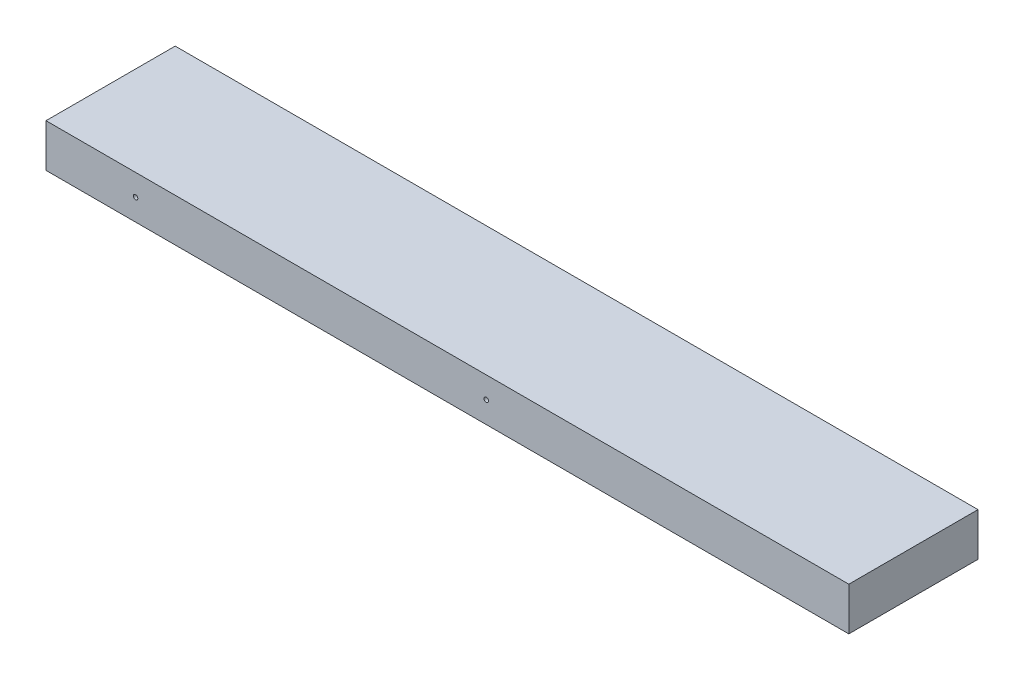
ISO-10303-21;
HEADER;
FILE_DESCRIPTION(('STEP AP214'),'2;1');
FILE_NAME('part.step','',(''),(''),'','','');
FILE_SCHEMA(('AUTOMOTIVE_DESIGN { 1 0 10303 214 1 1 1 1 }'));
ENDSEC;
DATA;
#1=APPLICATION_CONTEXT('core data for automotive mechanical design processes');
#2=APPLICATION_PROTOCOL_DEFINITION('international standard','automotive_design',2000,#1);
#3=PRODUCT_CONTEXT('',#1,'mechanical');
#4=PRODUCT('Part','Part','',(#3));
#5=PRODUCT_RELATED_PRODUCT_CATEGORY('part','',(#4));
#6=PRODUCT_DEFINITION_FORMATION('','',#4);
#7=PRODUCT_DEFINITION_CONTEXT('part definition',#1,'design');
#8=PRODUCT_DEFINITION('design','',#6,#7);
#9=PRODUCT_DEFINITION_SHAPE('','',#8);
#10=(LENGTH_UNIT() NAMED_UNIT(*) SI_UNIT(.MILLI.,.METRE.));
#11=(NAMED_UNIT(*) PLANE_ANGLE_UNIT() SI_UNIT($,.RADIAN.));
#12=(NAMED_UNIT(*) SI_UNIT($,.STERADIAN.) SOLID_ANGLE_UNIT());
#13=UNCERTAINTY_MEASURE_WITH_UNIT(LENGTH_MEASURE(1.E-05),#10,'distance_accuracy_value','');
#14=(GEOMETRIC_REPRESENTATION_CONTEXT(3) GLOBAL_UNCERTAINTY_ASSIGNED_CONTEXT((#13)) GLOBAL_UNIT_ASSIGNED_CONTEXT((#10,
#11,#12)) REPRESENTATION_CONTEXT('',''));
#15=CARTESIAN_POINT('',(0.,0.,0.));
#16=DIRECTION('',(0.,0.,1.));
#17=DIRECTION('',(1.,0.,0.));
#18=AXIS2_PLACEMENT_3D('',#15,#16,#17);
#19=CARTESIAN_POINT('',(86.3599999999995,5213.35,2683.51));
#20=DIRECTION('',(0.,-1.,0.));
#21=DIRECTION('',(0.,0.,-1.));
#22=AXIS2_PLACEMENT_3D('',#19,#20,#21);
#23=PLANE('',#22);
#24=DIRECTION('',(0.,0.,-1.));
#25=VECTOR('',#24,1.);
#26=CARTESIAN_POINT('',(90.1229654482441,5213.35,2740.66));
#27=LINE('',#26,#25);
#28=CARTESIAN_POINT('',(90.1229654482441,5213.35,2740.66));
#29=VERTEX_POINT('',#28);
#30=CARTESIAN_POINT('',(90.1229654482441,5213.35,2683.51));
#31=VERTEX_POINT('',#30);
#32=EDGE_CURVE('E96',#29,#31,#27,.T.);
#33=ORIENTED_EDGE('',*,*,#32,.T.);
#34=DIRECTION('',(1.,0.,0.));
#35=VECTOR('',#34,1.);
#36=CARTESIAN_POINT('',(265.815570864871,5213.35,2683.51));
#37=LINE('',#36,#35);
#38=CARTESIAN_POINT('',(445.271141729743,5213.35,2683.51));
#39=VERTEX_POINT('',#38);
#40=EDGE_CURVE('E102',#31,#39,#37,.T.);
#41=ORIENTED_EDGE('',*,*,#40,.T.);
#42=DIRECTION('',(0.,0.,-1.));
#43=VECTOR('',#42,1.);
#44=CARTESIAN_POINT('',(445.271141729743,5213.35,2683.51));
#45=LINE('',#44,#43);
#46=CARTESIAN_POINT('',(445.271141729743,5213.35,2740.66));
#47=VERTEX_POINT('',#46);
#48=EDGE_CURVE('E113',#47,#39,#45,.T.);
#49=ORIENTED_EDGE('',*,*,#48,.F.);
#50=DIRECTION('',(-1.,0.,0.));
#51=VECTOR('',#50,1.);
#52=CARTESIAN_POINT('',(265.815570864871,5213.35,2740.66));
#53=LINE('',#52,#51);
#54=EDGE_CURVE('E75',#47,#29,#53,.T.);
#55=ORIENTED_EDGE('',*,*,#54,.T.);
#56=EDGE_LOOP('',(#33,#41,#49,#55));
#57=FACE_BOUND('',#56,.T.);
#58=ADVANCED_FACE('F35',(#57),#23,.T.);
#59=CARTESIAN_POINT('',(265.815570864871,5222.875,2740.66));
#60=DIRECTION('',(0.,0.,-1.));
#61=DIRECTION('',(-1.,0.,0.));
#62=AXIS2_PLACEMENT_3D('',#59,#60,#61);
#63=PLANE('',#62);
#64=CARTESIAN_POINT('',(129.74574903147,5222.875,2740.66));
#65=DIRECTION('',(0.,0.,-1.));
#66=DIRECTION('',(-1.,0.,0.));
#67=AXIS2_PLACEMENT_3D('',#64,#65,#66);
#68=CIRCLE('',#67,0.991870000000006);
#69=CARTESIAN_POINT('',(128.75387903147,5222.875,2740.66));
#70=VERTEX_POINT('',#69);
#71=EDGE_CURVE('E38',#70,#70,#68,.T.);
#72=ORIENTED_EDGE('',*,*,#71,.T.);
#73=EDGE_LOOP('',(#72));
#74=FACE_BOUND('',#73,.T.);
#75=CARTESIAN_POINT('',(284.876857239857,5222.875,2740.66));
#76=DIRECTION('',(0.,0.,-1.));
#77=DIRECTION('',(-1.,0.,0.));
#78=AXIS2_PLACEMENT_3D('',#75,#76,#77);
#79=CIRCLE('',#78,0.991870000000006);
#80=CARTESIAN_POINT('',(283.884987239857,5222.875,2740.66));
#81=VERTEX_POINT('',#80);
#82=EDGE_CURVE('E117',#81,#81,#79,.T.);
#83=ORIENTED_EDGE('',*,*,#82,.T.);
#84=EDGE_LOOP('',(#83));
#85=FACE_BOUND('',#84,.T.);
#86=DIRECTION('',(1.,0.,0.));
#87=VECTOR('',#86,1.);
#88=CARTESIAN_POINT('',(445.271141729743,5232.4,2740.66));
#89=LINE('',#88,#87);
#90=CARTESIAN_POINT('',(90.1229654482441,5232.4,2740.66));
#91=VERTEX_POINT('',#90);
#92=CARTESIAN_POINT('',(445.271141729743,5232.4,2740.66));
#93=VERTEX_POINT('',#92);
#94=EDGE_CURVE('E105',#91,#93,#89,.T.);
#95=ORIENTED_EDGE('',*,*,#94,.F.);
#96=DIRECTION('',(0.,-1.,0.));
#97=VECTOR('',#96,1.);
#98=CARTESIAN_POINT('',(90.1229654482441,5213.35,2740.66));
#99=LINE('',#98,#97);
#100=EDGE_CURVE('E51',#91,#29,#99,.T.);
#101=ORIENTED_EDGE('',*,*,#100,.T.);
#102=ORIENTED_EDGE('',*,*,#54,.F.);
#103=DIRECTION('',(0.,1.,0.));
#104=VECTOR('',#103,1.);
#105=CARTESIAN_POINT('',(445.271141729743,5213.35,2740.66));
#106=LINE('',#105,#104);
#107=EDGE_CURVE('E115',#93,#47,#106,.F.);
#108=ORIENTED_EDGE('',*,*,#107,.F.);
#109=EDGE_LOOP('',(#95,#101,#102,#108));
#110=FACE_BOUND('',#109,.T.);
#111=ADVANCED_FACE('F131',(#74,#85,#110),#63,.F.);
#112=CARTESIAN_POINT('',(445.271141729743,5213.35,2683.51));
#113=DIRECTION('',(1.,0.,0.));
#114=DIRECTION('',(0.,0.,-1.));
#115=AXIS2_PLACEMENT_3D('',#112,#113,#114);
#116=PLANE('',#115);
#117=DIRECTION('',(0.,1.,0.));
#118=VECTOR('',#117,1.);
#119=CARTESIAN_POINT('',(445.271141729743,5222.875,2683.51));
#120=LINE('',#119,#118);
#121=CARTESIAN_POINT('',(445.271141729743,5232.4,2683.51));
#122=VERTEX_POINT('',#121);
#123=EDGE_CURVE('E60',#39,#122,#120,.T.);
#124=ORIENTED_EDGE('',*,*,#123,.T.);
#125=DIRECTION('',(0.,0.,1.));
#126=VECTOR('',#125,1.);
#127=CARTESIAN_POINT('',(445.271141729743,5232.4,2683.51));
#128=LINE('',#127,#126);
#129=EDGE_CURVE('E43',#93,#122,#128,.F.);
#130=ORIENTED_EDGE('',*,*,#129,.F.);
#131=ORIENTED_EDGE('',*,*,#107,.T.);
#132=ORIENTED_EDGE('',*,*,#48,.T.);
#133=EDGE_LOOP('',(#124,#130,#131,#132));
#134=FACE_BOUND('',#133,.T.);
#135=ADVANCED_FACE('F133',(#134),#116,.T.);
#136=CARTESIAN_POINT('',(265.815570864871,5222.875,2683.51));
#137=DIRECTION('',(0.,0.,1.));
#138=DIRECTION('',(1.,0.,0.));
#139=AXIS2_PLACEMENT_3D('',#136,#137,#138);
#140=PLANE('',#139);
#141=ORIENTED_EDGE('',*,*,#40,.F.);
#142=DIRECTION('',(0.,-1.,0.));
#143=VECTOR('',#142,1.);
#144=CARTESIAN_POINT('',(90.1229654482441,5213.35,2683.51));
#145=LINE('',#144,#143);
#146=CARTESIAN_POINT('',(90.1229654482441,5232.4,2683.51));
#147=VERTEX_POINT('',#146);
#148=EDGE_CURVE('E92',#147,#31,#145,.T.);
#149=ORIENTED_EDGE('',*,*,#148,.F.);
#150=DIRECTION('',(1.,0.,0.));
#151=VECTOR('',#150,1.);
#152=CARTESIAN_POINT('',(445.271141729743,5232.4,2683.51));
#153=LINE('',#152,#151);
#154=EDGE_CURVE('E11',#122,#147,#153,.F.);
#155=ORIENTED_EDGE('',*,*,#154,.F.);
#156=ORIENTED_EDGE('',*,*,#123,.F.);
#157=EDGE_LOOP('',(#141,#149,#155,#156));
#158=FACE_BOUND('',#157,.T.);
#159=ADVANCED_FACE('F100',(#158),#140,.F.);
#160=CARTESIAN_POINT('',(445.271141729743,5232.4,2683.51));
#161=DIRECTION('',(0.,1.,0.));
#162=DIRECTION('',(0.,0.,1.));
#163=AXIS2_PLACEMENT_3D('',#160,#161,#162);
#164=PLANE('',#163);
#165=DIRECTION('',(0.,0.,-1.));
#166=VECTOR('',#165,1.);
#167=CARTESIAN_POINT('',(90.1229654482441,5232.4,2740.66));
#168=LINE('',#167,#166);
#169=EDGE_CURVE('E89',#91,#147,#168,.T.);
#170=ORIENTED_EDGE('',*,*,#169,.F.);
#171=ORIENTED_EDGE('',*,*,#94,.T.);
#172=ORIENTED_EDGE('',*,*,#129,.T.);
#173=ORIENTED_EDGE('',*,*,#154,.T.);
#174=EDGE_LOOP('',(#170,#171,#172,#173));
#175=FACE_BOUND('',#174,.T.);
#176=ADVANCED_FACE('F104',(#175),#164,.T.);
#177=CARTESIAN_POINT('',(284.876857239857,5222.875,2759.71000000001));
#178=DIRECTION('',(0.,0.,1.));
#179=DIRECTION('',(1.,0.,0.));
#180=AXIS2_PLACEMENT_3D('',#177,#178,#179);
#181=CYLINDRICAL_SURFACE('',#180,0.991870000000006);
#182=CARTESIAN_POINT('',(284.876857239857,5222.875,2721.61000000001));
#183=DIRECTION('',(0.,0.,1.));
#184=DIRECTION('',(1.,0.,0.));
#185=AXIS2_PLACEMENT_3D('',#182,#183,#184);
#186=CIRCLE('',#185,0.991870000000006);
#187=CARTESIAN_POINT('',(285.868727239857,5222.875,2721.61000000001));
#188=VERTEX_POINT('',#187);
#189=EDGE_CURVE('E119',#188,#188,#186,.T.);
#190=ORIENTED_EDGE('',*,*,#189,.F.);
#191=EDGE_LOOP('',(#190));
#192=FACE_BOUND('',#191,.T.);
#193=ORIENTED_EDGE('',*,*,#82,.F.);
#194=EDGE_LOOP('',(#193));
#195=FACE_BOUND('',#194,.T.);
#196=ADVANCED_FACE('F143',(#192,#195),#181,.F.);
#197=CARTESIAN_POINT('',(284.876857239857,5222.875,2721.61000000001));
#198=DIRECTION('',(0.,0.,1.));
#199=DIRECTION('',(1.,0.,0.));
#200=AXIS2_PLACEMENT_3D('',#197,#198,#199);
#201=CONICAL_SURFACE('',#200,0.991870000000006,1.02974425867677);
#202=CARTESIAN_POINT('',(284.876857239857,5222.875,2721.01402437781));
#203=VERTEX_POINT('',#202);
#204=VERTEX_LOOP('',#203);
#205=FACE_BOUND('',#204,.T.);
#206=ORIENTED_EDGE('',*,*,#189,.T.);
#207=EDGE_LOOP('',(#206));
#208=FACE_BOUND('',#207,.T.);
#209=ADVANCED_FACE('F148',(#205,#208),#201,.F.);
#210=CARTESIAN_POINT('',(129.74574903147,5222.875,2759.71000000001));
#211=DIRECTION('',(0.,0.,1.));
#212=DIRECTION('',(1.,0.,0.));
#213=AXIS2_PLACEMENT_3D('',#210,#211,#212);
#214=CYLINDRICAL_SURFACE('',#213,0.991870000000006);
#215=CARTESIAN_POINT('',(129.74574903147,5222.875,2721.61000000001));
#216=DIRECTION('',(0.,0.,1.));
#217=DIRECTION('',(1.,0.,0.));
#218=AXIS2_PLACEMENT_3D('',#215,#216,#217);
#219=CIRCLE('',#218,0.991870000000006);
#220=CARTESIAN_POINT('',(130.73761903147,5222.875,2721.61000000001));
#221=VERTEX_POINT('',#220);
#222=EDGE_CURVE('E126',#221,#221,#219,.T.);
#223=ORIENTED_EDGE('',*,*,#222,.F.);
#224=EDGE_LOOP('',(#223));
#225=FACE_BOUND('',#224,.T.);
#226=ORIENTED_EDGE('',*,*,#71,.F.);
#227=EDGE_LOOP('',(#226));
#228=FACE_BOUND('',#227,.T.);
#229=ADVANCED_FACE('F153',(#225,#228),#214,.F.);
#230=CARTESIAN_POINT('',(129.74574903147,5222.875,2721.61000000001));
#231=DIRECTION('',(0.,0.,1.));
#232=DIRECTION('',(1.,0.,0.));
#233=AXIS2_PLACEMENT_3D('',#230,#231,#232);
#234=CONICAL_SURFACE('',#233,0.991870000000006,1.02974425867677);
#235=CARTESIAN_POINT('',(129.74574903147,5222.875,2721.01402437781));
#236=VERTEX_POINT('',#235);
#237=VERTEX_LOOP('',#236);
#238=FACE_BOUND('',#237,.T.);
#239=ORIENTED_EDGE('',*,*,#222,.T.);
#240=EDGE_LOOP('',(#239));
#241=FACE_BOUND('',#240,.T.);
#242=ADVANCED_FACE('F155',(#238,#241),#234,.F.);
#243=CARTESIAN_POINT('',(90.1229654482441,5213.35,2740.66));
#244=DIRECTION('',(1.,0.,0.));
#245=DIRECTION('',(0.,0.,-1.));
#246=AXIS2_PLACEMENT_3D('',#243,#244,#245);
#247=PLANE('',#246);
#248=ORIENTED_EDGE('',*,*,#148,.T.);
#249=ORIENTED_EDGE('',*,*,#32,.F.);
#250=ORIENTED_EDGE('',*,*,#100,.F.);
#251=ORIENTED_EDGE('',*,*,#169,.T.);
#252=EDGE_LOOP('',(#248,#249,#250,#251));
#253=FACE_BOUND('',#252,.T.);
#254=ADVANCED_FACE('F91',(#253),#247,.F.);
#255=CLOSED_SHELL('',(#58,#111,#135,#159,#176,#196,#209,#229,#242,#254));
#256=MANIFOLD_SOLID_BREP('B2',#255);
#257=ADVANCED_BREP_SHAPE_REPRESENTATION('',(#18,#256),#14);
#258=SHAPE_DEFINITION_REPRESENTATION(#9,#257);
ENDSEC;
END-ISO-10303-21;
